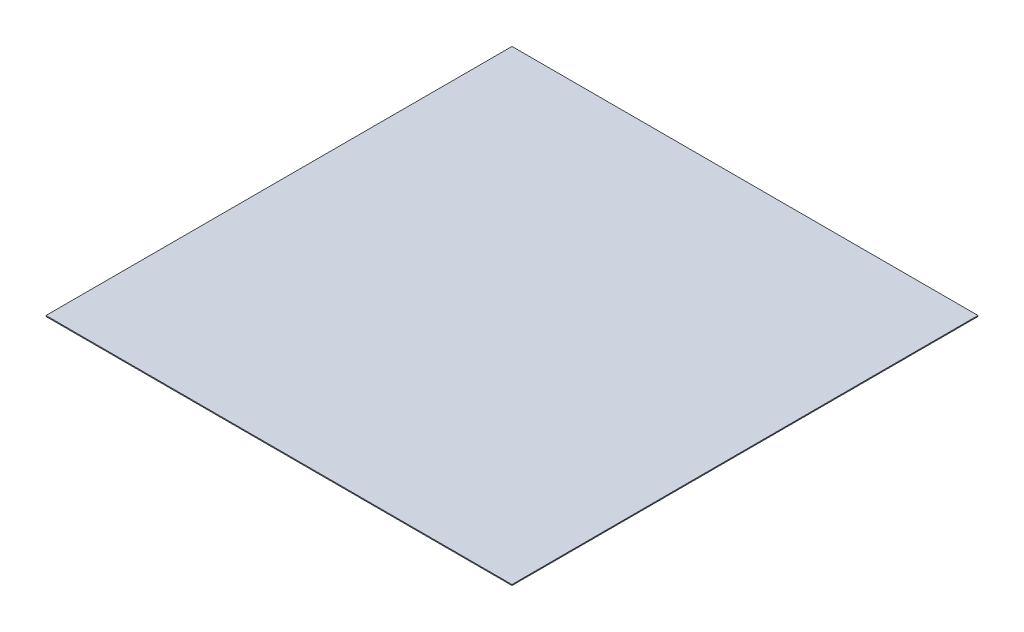
ISO-10303-21;
HEADER;
FILE_DESCRIPTION(('STEP AP214'),'2;1');
FILE_NAME('part.step','',(''),(''),'','','');
FILE_SCHEMA(('AUTOMOTIVE_DESIGN { 1 0 10303 214 1 1 1 1 }'));
ENDSEC;
DATA;
#1=APPLICATION_CONTEXT('core data for automotive mechanical design processes');
#2=APPLICATION_PROTOCOL_DEFINITION('international standard','automotive_design',2000,#1);
#3=PRODUCT_CONTEXT('',#1,'mechanical');
#4=PRODUCT('Part','Part','',(#3));
#5=PRODUCT_RELATED_PRODUCT_CATEGORY('part','',(#4));
#6=PRODUCT_DEFINITION_FORMATION('','',#4);
#7=PRODUCT_DEFINITION_CONTEXT('part definition',#1,'design');
#8=PRODUCT_DEFINITION('design','',#6,#7);
#9=PRODUCT_DEFINITION_SHAPE('','',#8);
#10=(LENGTH_UNIT() NAMED_UNIT(*) SI_UNIT(.MILLI.,.METRE.));
#11=(NAMED_UNIT(*) PLANE_ANGLE_UNIT() SI_UNIT($,.RADIAN.));
#12=(NAMED_UNIT(*) SI_UNIT($,.STERADIAN.) SOLID_ANGLE_UNIT());
#13=UNCERTAINTY_MEASURE_WITH_UNIT(LENGTH_MEASURE(1.E-05),#10,'distance_accuracy_value','');
#14=(GEOMETRIC_REPRESENTATION_CONTEXT(3) GLOBAL_UNCERTAINTY_ASSIGNED_CONTEXT((#13)) GLOBAL_UNIT_ASSIGNED_CONTEXT((#10,
#11,#12)) REPRESENTATION_CONTEXT('',''));
#15=CARTESIAN_POINT('',(0.,0.,0.));
#16=DIRECTION('',(0.,0.,1.));
#17=DIRECTION('',(1.,0.,0.));
#18=AXIS2_PLACEMENT_3D('',#15,#16,#17);
#19=CARTESIAN_POINT('',(5000.,20.,-5000.));
#20=DIRECTION('',(-1.,0.,0.));
#21=DIRECTION('',(0.,0.,1.));
#22=AXIS2_PLACEMENT_3D('',#19,#20,#21);
#23=PLANE('',#22);
#24=DIRECTION('',(0.,0.,-1.));
#25=VECTOR('',#24,1.);
#26=CARTESIAN_POINT('',(5000.,0.,-5000.));
#27=LINE('',#26,#25);
#28=CARTESIAN_POINT('',(5000.,0.,5000.));
#29=VERTEX_POINT('',#28);
#30=CARTESIAN_POINT('',(5000.,0.,-5000.));
#31=VERTEX_POINT('',#30);
#32=EDGE_CURVE('E107',#29,#31,#27,.T.);
#33=ORIENTED_EDGE('',*,*,#32,.T.);
#34=DIRECTION('',(0.,-1.,0.));
#35=VECTOR('',#34,1.);
#36=CARTESIAN_POINT('',(5000.,20.,-5000.));
#37=LINE('',#36,#35);
#38=CARTESIAN_POINT('',(5000.,20.,-5000.));
#39=VERTEX_POINT('',#38);
#40=EDGE_CURVE('E11',#39,#31,#37,.T.);
#41=ORIENTED_EDGE('',*,*,#40,.F.);
#42=DIRECTION('',(0.,0.,-1.));
#43=VECTOR('',#42,1.);
#44=CARTESIAN_POINT('',(5000.,20.,-5000.));
#45=LINE('',#44,#43);
#46=CARTESIAN_POINT('',(5000.,20.,5000.));
#47=VERTEX_POINT('',#46);
#48=EDGE_CURVE('E91',#47,#39,#45,.T.);
#49=ORIENTED_EDGE('',*,*,#48,.F.);
#50=DIRECTION('',(0.,-1.,0.));
#51=VECTOR('',#50,1.);
#52=CARTESIAN_POINT('',(5000.,20.,5000.));
#53=LINE('',#52,#51);
#54=EDGE_CURVE('E103',#47,#29,#53,.T.);
#55=ORIENTED_EDGE('',*,*,#54,.T.);
#56=EDGE_LOOP('',(#33,#41,#49,#55));
#57=FACE_BOUND('',#56,.T.);
#58=ADVANCED_FACE('F39',(#57),#23,.F.);
#59=CARTESIAN_POINT('',(-5000.,20.,-5000.));
#60=DIRECTION('',(0.,0.,1.));
#61=DIRECTION('',(1.,0.,0.));
#62=AXIS2_PLACEMENT_3D('',#59,#60,#61);
#63=PLANE('',#62);
#64=DIRECTION('',(-1.,0.,0.));
#65=VECTOR('',#64,1.);
#66=CARTESIAN_POINT('',(-5000.,0.,-5000.));
#67=LINE('',#66,#65);
#68=CARTESIAN_POINT('',(-5000.,0.,-5000.));
#69=VERTEX_POINT('',#68);
#70=EDGE_CURVE('E96',#31,#69,#67,.T.);
#71=ORIENTED_EDGE('',*,*,#70,.T.);
#72=DIRECTION('',(0.,-1.,0.));
#73=VECTOR('',#72,1.);
#74=CARTESIAN_POINT('',(-5000.,20.,-5000.));
#75=LINE('',#74,#73);
#76=CARTESIAN_POINT('',(-5000.,20.,-5000.));
#77=VERTEX_POINT('',#76);
#78=EDGE_CURVE('E48',#77,#69,#75,.T.);
#79=ORIENTED_EDGE('',*,*,#78,.F.);
#80=DIRECTION('',(-1.,0.,0.));
#81=VECTOR('',#80,1.);
#82=CARTESIAN_POINT('',(-5000.,20.,-5000.));
#83=LINE('',#82,#81);
#84=EDGE_CURVE('E86',#39,#77,#83,.T.);
#85=ORIENTED_EDGE('',*,*,#84,.F.);
#86=ORIENTED_EDGE('',*,*,#40,.T.);
#87=EDGE_LOOP('',(#71,#79,#85,#86));
#88=FACE_BOUND('',#87,.T.);
#89=ADVANCED_FACE('F95',(#88),#63,.F.);
#90=CARTESIAN_POINT('',(-5000.,20.,-5000.));
#91=DIRECTION('',(1.,0.,0.));
#92=DIRECTION('',(0.,0.,-1.));
#93=AXIS2_PLACEMENT_3D('',#90,#91,#92);
#94=PLANE('',#93);
#95=DIRECTION('',(0.,0.,1.));
#96=VECTOR('',#95,1.);
#97=CARTESIAN_POINT('',(-5000.,0.,-5000.));
#98=LINE('',#97,#96);
#99=CARTESIAN_POINT('',(-5000.,0.,5000.));
#100=VERTEX_POINT('',#99);
#101=EDGE_CURVE('E73',#69,#100,#98,.T.);
#102=ORIENTED_EDGE('',*,*,#101,.T.);
#103=DIRECTION('',(0.,-1.,0.));
#104=VECTOR('',#103,1.);
#105=CARTESIAN_POINT('',(-5000.,20.,5000.));
#106=LINE('',#105,#104);
#107=CARTESIAN_POINT('',(-5000.,20.,5000.));
#108=VERTEX_POINT('',#107);
#109=EDGE_CURVE('E98',#108,#100,#106,.T.);
#110=ORIENTED_EDGE('',*,*,#109,.F.);
#111=DIRECTION('',(0.,0.,1.));
#112=VECTOR('',#111,1.);
#113=CARTESIAN_POINT('',(-5000.,20.,-5000.));
#114=LINE('',#113,#112);
#115=EDGE_CURVE('E89',#77,#108,#114,.T.);
#116=ORIENTED_EDGE('',*,*,#115,.F.);
#117=ORIENTED_EDGE('',*,*,#78,.T.);
#118=EDGE_LOOP('',(#102,#110,#116,#117));
#119=FACE_BOUND('',#118,.T.);
#120=ADVANCED_FACE('F99',(#119),#94,.F.);
#121=CARTESIAN_POINT('',(-5000.,20.,5000.));
#122=DIRECTION('',(0.,0.,-1.));
#123=DIRECTION('',(-1.,0.,0.));
#124=AXIS2_PLACEMENT_3D('',#121,#122,#123);
#125=PLANE('',#124);
#126=DIRECTION('',(1.,0.,0.));
#127=VECTOR('',#126,1.);
#128=CARTESIAN_POINT('',(-5000.,0.,5000.));
#129=LINE('',#128,#127);
#130=EDGE_CURVE('E79',#100,#29,#129,.T.);
#131=ORIENTED_EDGE('',*,*,#130,.T.);
#132=ORIENTED_EDGE('',*,*,#54,.F.);
#133=DIRECTION('',(1.,0.,0.));
#134=VECTOR('',#133,1.);
#135=CARTESIAN_POINT('',(-5000.,20.,5000.));
#136=LINE('',#135,#134);
#137=EDGE_CURVE('E56',#108,#47,#136,.T.);
#138=ORIENTED_EDGE('',*,*,#137,.F.);
#139=ORIENTED_EDGE('',*,*,#109,.T.);
#140=EDGE_LOOP('',(#131,#132,#138,#139));
#141=FACE_BOUND('',#140,.T.);
#142=ADVANCED_FACE('F120',(#141),#125,.F.);
#143=CARTESIAN_POINT('',(0.,20.,0.));
#144=DIRECTION('',(0.,1.,0.));
#145=DIRECTION('',(0.,0.,1.));
#146=AXIS2_PLACEMENT_3D('',#143,#144,#145);
#147=PLANE('',#146);
#148=ORIENTED_EDGE('',*,*,#48,.T.);
#149=ORIENTED_EDGE('',*,*,#84,.T.);
#150=ORIENTED_EDGE('',*,*,#115,.T.);
#151=ORIENTED_EDGE('',*,*,#137,.T.);
#152=EDGE_LOOP('',(#148,#149,#150,#151));
#153=FACE_BOUND('',#152,.T.);
#154=ADVANCED_FACE('F87',(#153),#147,.T.);
#155=CARTESIAN_POINT('',(0.,0.,0.));
#156=DIRECTION('',(0.,1.,0.));
#157=DIRECTION('',(0.,0.,1.));
#158=AXIS2_PLACEMENT_3D('',#155,#156,#157);
#159=PLANE('',#158);
#160=ORIENTED_EDGE('',*,*,#32,.F.);
#161=ORIENTED_EDGE('',*,*,#130,.F.);
#162=ORIENTED_EDGE('',*,*,#101,.F.);
#163=ORIENTED_EDGE('',*,*,#70,.F.);
#164=EDGE_LOOP('',(#160,#161,#162,#163));
#165=FACE_BOUND('',#164,.T.);
#166=ADVANCED_FACE('F123',(#165),#159,.F.);
#167=CLOSED_SHELL('',(#58,#89,#120,#142,#154,#166));
#168=MANIFOLD_SOLID_BREP('B2',#167);
#169=ADVANCED_BREP_SHAPE_REPRESENTATION('',(#18,#168),#14);
#170=SHAPE_DEFINITION_REPRESENTATION(#9,#169);
ENDSEC;
END-ISO-10303-21;
